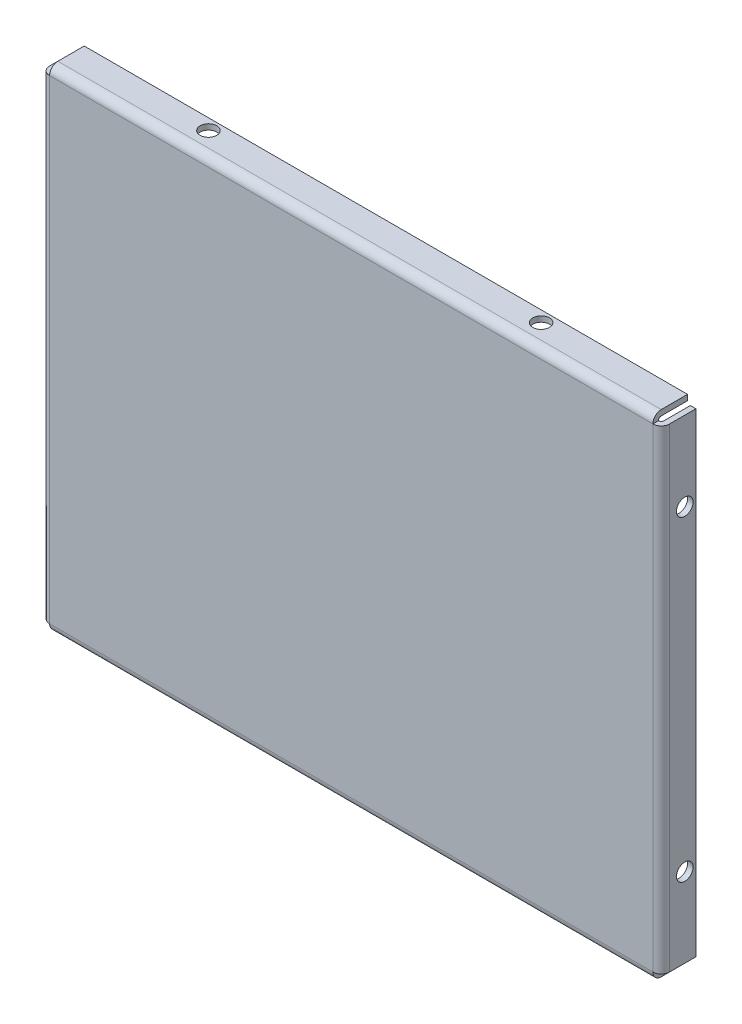
ISO-10303-21;
HEADER;
FILE_DESCRIPTION(('STEP AP214'),'2;1');
FILE_NAME('part.step','',(''),(''),'','','');
FILE_SCHEMA(('AUTOMOTIVE_DESIGN { 1 0 10303 214 1 1 1 1 }'));
ENDSEC;
DATA;
#1=APPLICATION_CONTEXT('core data for automotive mechanical design processes');
#2=APPLICATION_PROTOCOL_DEFINITION('international standard','automotive_design',2000,#1);
#3=PRODUCT_CONTEXT('',#1,'mechanical');
#4=PRODUCT('Part','Part','',(#3));
#5=PRODUCT_RELATED_PRODUCT_CATEGORY('part','',(#4));
#6=PRODUCT_DEFINITION_FORMATION('','',#4);
#7=PRODUCT_DEFINITION_CONTEXT('part definition',#1,'design');
#8=PRODUCT_DEFINITION('design','',#6,#7);
#9=PRODUCT_DEFINITION_SHAPE('','',#8);
#10=(LENGTH_UNIT() NAMED_UNIT(*) SI_UNIT(.MILLI.,.METRE.));
#11=(NAMED_UNIT(*) PLANE_ANGLE_UNIT() SI_UNIT($,.RADIAN.));
#12=(NAMED_UNIT(*) SI_UNIT($,.STERADIAN.) SOLID_ANGLE_UNIT());
#13=UNCERTAINTY_MEASURE_WITH_UNIT(LENGTH_MEASURE(1.E-05),#10,'distance_accuracy_value','');
#14=(GEOMETRIC_REPRESENTATION_CONTEXT(3) GLOBAL_UNCERTAINTY_ASSIGNED_CONTEXT((#13)) GLOBAL_UNIT_ASSIGNED_CONTEXT((#10,
#11,#12)) REPRESENTATION_CONTEXT('',''));
#15=CARTESIAN_POINT('',(0.,0.,0.));
#16=DIRECTION('',(0.,0.,1.));
#17=DIRECTION('',(1.,0.,0.));
#18=AXIS2_PLACEMENT_3D('',#15,#16,#17);
#19=CARTESIAN_POINT('',(0.,0.,1.7));
#20=DIRECTION('',(0.,0.,-1.));
#21=DIRECTION('',(-1.,0.,0.));
#22=AXIS2_PLACEMENT_3D('',#19,#20,#21);
#23=PLANE('',#22);
#24=DIRECTION('',(0.,-1.,0.));
#25=VECTOR('',#24,1.);
#26=CARTESIAN_POINT('',(23.31,0.,1.7));
#27=LINE('',#26,#25);
#28=CARTESIAN_POINT('',(23.31,29.28,1.7));
#29=VERTEX_POINT('',#28);
#30=CARTESIAN_POINT('',(23.31,12.16,1.7));
#31=VERTEX_POINT('',#30);
#32=EDGE_CURVE('E135',#29,#31,#27,.T.);
#33=ORIENTED_EDGE('',*,*,#32,.F.);
#34=DIRECTION('',(1.,0.,0.));
#35=VECTOR('',#34,1.);
#36=CARTESIAN_POINT('',(1.55,29.28,1.7));
#37=LINE('',#36,#35);
#38=CARTESIAN_POINT('',(1.55,29.28,1.7));
#39=VERTEX_POINT('',#38);
#40=EDGE_CURVE('E246',#39,#29,#37,.T.);
#41=ORIENTED_EDGE('',*,*,#40,.F.);
#42=DIRECTION('',(0.,1.,0.));
#43=VECTOR('',#42,1.);
#44=CARTESIAN_POINT('',(1.55,0.,1.7));
#45=LINE('',#44,#43);
#46=CARTESIAN_POINT('',(1.55,12.16,1.7));
#47=VERTEX_POINT('',#46);
#48=EDGE_CURVE('E138',#47,#39,#45,.T.);
#49=ORIENTED_EDGE('',*,*,#48,.F.);
#50=DIRECTION('',(1.,0.,0.));
#51=VECTOR('',#50,1.);
#52=CARTESIAN_POINT('',(0.,12.16,1.7));
#53=LINE('',#52,#51);
#54=EDGE_CURVE('E124',#31,#47,#53,.F.);
#55=ORIENTED_EDGE('',*,*,#54,.F.);
#56=EDGE_LOOP('',(#33,#41,#49,#55));
#57=FACE_BOUND('',#56,.T.);
#58=ADVANCED_FACE('F17',(#57),#23,.F.);
#59=CARTESIAN_POINT('',(23.31,0.,1.4));
#60=DIRECTION('',(0.,-1.,0.));
#61=DIRECTION('',(0.,0.,-1.));
#62=AXIS2_PLACEMENT_3D('',#59,#60,#61);
#63=CYLINDRICAL_SURFACE('',#62,0.3);
#64=CARTESIAN_POINT('',(23.31,29.28,1.4));
#65=DIRECTION('',(0.,-1.,0.));
#66=DIRECTION('',(0.,0.,-1.));
#67=AXIS2_PLACEMENT_3D('',#64,#65,#66);
#68=CIRCLE('',#67,0.3);
#69=CARTESIAN_POINT('',(23.61,29.28,1.4));
#70=VERTEX_POINT('',#69);
#71=EDGE_CURVE('E116',#70,#29,#68,.T.);
#72=ORIENTED_EDGE('',*,*,#71,.T.);
#73=ORIENTED_EDGE('',*,*,#32,.T.);
#74=CARTESIAN_POINT('',(23.31,12.16,1.4));
#75=DIRECTION('',(0.,-1.,0.));
#76=DIRECTION('',(0.,0.,-1.));
#77=AXIS2_PLACEMENT_3D('',#74,#75,#76);
#78=CIRCLE('',#77,0.3);
#79=CARTESIAN_POINT('',(23.61,12.16,1.4));
#80=VERTEX_POINT('',#79);
#81=EDGE_CURVE('E20',#31,#80,#78,.F.);
#82=ORIENTED_EDGE('',*,*,#81,.T.);
#83=DIRECTION('',(0.,1.,0.));
#84=VECTOR('',#83,1.);
#85=CARTESIAN_POINT('',(23.61,29.58,1.4));
#86=LINE('',#85,#84);
#87=EDGE_CURVE('E258',#70,#80,#86,.F.);
#88=ORIENTED_EDGE('',*,*,#87,.F.);
#89=EDGE_LOOP('',(#72,#73,#82,#88));
#90=FACE_BOUND('',#89,.T.);
#91=ADVANCED_FACE('F151',(#90),#63,.T.);
#92=CARTESIAN_POINT('',(0.,12.16,1.4));
#93=DIRECTION('',(1.,0.,0.));
#94=DIRECTION('',(0.,0.,-1.));
#95=AXIS2_PLACEMENT_3D('',#92,#93,#94);
#96=CYLINDRICAL_SURFACE('',#95,0.3);
#97=CARTESIAN_POINT('',(23.31,12.16,1.4));
#98=DIRECTION('',(1.,0.,0.));
#99=DIRECTION('',(0.,0.,-1.));
#100=AXIS2_PLACEMENT_3D('',#97,#98,#99);
#101=CIRCLE('',#100,0.3);
#102=CARTESIAN_POINT('',(23.31,11.86,1.4));
#103=VERTEX_POINT('',#102);
#104=EDGE_CURVE('E120',#103,#31,#101,.F.);
#105=ORIENTED_EDGE('',*,*,#104,.T.);
#106=ORIENTED_EDGE('',*,*,#54,.T.);
#107=CARTESIAN_POINT('',(1.55,12.16,1.4));
#108=DIRECTION('',(1.,0.,0.));
#109=DIRECTION('',(0.,0.,-1.));
#110=AXIS2_PLACEMENT_3D('',#107,#108,#109);
#111=CIRCLE('',#110,0.3);
#112=CARTESIAN_POINT('',(1.55,11.86,1.4));
#113=VERTEX_POINT('',#112);
#114=EDGE_CURVE('E130',#47,#113,#111,.T.);
#115=ORIENTED_EDGE('',*,*,#114,.T.);
#116=DIRECTION('',(1.,0.,0.));
#117=VECTOR('',#116,1.);
#118=CARTESIAN_POINT('',(1.55,11.86,1.4));
#119=LINE('',#118,#117);
#120=EDGE_CURVE('E126',#113,#103,#119,.T.);
#121=ORIENTED_EDGE('',*,*,#120,.T.);
#122=EDGE_LOOP('',(#105,#106,#115,#121));
#123=FACE_BOUND('',#122,.T.);
#124=ADVANCED_FACE('F122',(#123),#96,.T.);
#125=CARTESIAN_POINT('',(1.55,0.,1.4));
#126=DIRECTION('',(0.,1.,0.));
#127=DIRECTION('',(0.,0.,1.));
#128=AXIS2_PLACEMENT_3D('',#125,#126,#127);
#129=CYLINDRICAL_SURFACE('',#128,0.3);
#130=CARTESIAN_POINT('',(1.55,29.28,1.4));
#131=DIRECTION('',(0.,1.,0.));
#132=DIRECTION('',(0.,0.,1.));
#133=AXIS2_PLACEMENT_3D('',#130,#131,#132);
#134=CIRCLE('',#133,0.3);
#135=CARTESIAN_POINT('',(1.25,29.28,1.4));
#136=VERTEX_POINT('',#135);
#137=EDGE_CURVE('E250',#39,#136,#134,.F.);
#138=ORIENTED_EDGE('',*,*,#137,.T.);
#139=DIRECTION('',(0.,1.,0.));
#140=VECTOR('',#139,1.);
#141=CARTESIAN_POINT('',(1.25,0.,1.4));
#142=LINE('',#141,#140);
#143=CARTESIAN_POINT('',(1.25,12.16,1.4));
#144=VERTEX_POINT('',#143);
#145=EDGE_CURVE('E263',#136,#144,#142,.F.);
#146=ORIENTED_EDGE('',*,*,#145,.T.);
#147=CARTESIAN_POINT('',(1.55,12.16,1.4));
#148=DIRECTION('',(0.,1.,0.));
#149=DIRECTION('',(0.,0.,1.));
#150=AXIS2_PLACEMENT_3D('',#147,#148,#149);
#151=CIRCLE('',#150,0.3);
#152=EDGE_CURVE('E140',#144,#47,#151,.T.);
#153=ORIENTED_EDGE('',*,*,#152,.T.);
#154=ORIENTED_EDGE('',*,*,#48,.T.);
#155=EDGE_LOOP('',(#138,#146,#153,#154));
#156=FACE_BOUND('',#155,.T.);
#157=ADVANCED_FACE('F559',(#156),#129,.T.);
#158=CARTESIAN_POINT('',(1.55,29.28,1.4));
#159=DIRECTION('',(1.,0.,0.));
#160=DIRECTION('',(0.,0.,-1.));
#161=AXIS2_PLACEMENT_3D('',#158,#159,#160);
#162=CYLINDRICAL_SURFACE('',#161,0.3);
#163=CARTESIAN_POINT('',(23.31,29.28,1.4));
#164=DIRECTION('',(1.,0.,0.));
#165=DIRECTION('',(0.,0.,-1.));
#166=AXIS2_PLACEMENT_3D('',#163,#164,#165);
#167=CIRCLE('',#166,0.3);
#168=CARTESIAN_POINT('',(23.31,29.58,1.4));
#169=VERTEX_POINT('',#168);
#170=EDGE_CURVE('E242',#29,#169,#167,.F.);
#171=ORIENTED_EDGE('',*,*,#170,.T.);
#172=DIRECTION('',(1.,0.,0.));
#173=VECTOR('',#172,1.);
#174=CARTESIAN_POINT('',(1.55,29.58,1.4));
#175=LINE('',#174,#173);
#176=CARTESIAN_POINT('',(1.55,29.58,1.4));
#177=VERTEX_POINT('',#176);
#178=EDGE_CURVE('E267',#169,#177,#175,.F.);
#179=ORIENTED_EDGE('',*,*,#178,.T.);
#180=CARTESIAN_POINT('',(1.55,29.28,1.4));
#181=DIRECTION('',(1.,0.,0.));
#182=DIRECTION('',(0.,0.,-1.));
#183=AXIS2_PLACEMENT_3D('',#180,#181,#182);
#184=CIRCLE('',#183,0.3);
#185=EDGE_CURVE('E247',#177,#39,#184,.T.);
#186=ORIENTED_EDGE('',*,*,#185,.T.);
#187=ORIENTED_EDGE('',*,*,#40,.T.);
#188=EDGE_LOOP('',(#171,#179,#186,#187));
#189=FACE_BOUND('',#188,.T.);
#190=ADVANCED_FACE('F557',(#189),#162,.T.);
#191=CARTESIAN_POINT('',(23.61,29.58,0.4));
#192=DIRECTION('',(1.,0.,0.));
#193=DIRECTION('',(0.,0.,-1.));
#194=AXIS2_PLACEMENT_3D('',#191,#192,#193);
#195=PLANE('',#194);
#196=DIRECTION('',(0.,0.,-1.));
#197=VECTOR('',#196,1.);
#198=CARTESIAN_POINT('',(23.61,12.16,0.4));
#199=LINE('',#198,#197);
#200=CARTESIAN_POINT('',(23.61,12.16,0.45));
#201=VERTEX_POINT('',#200);
#202=EDGE_CURVE('E111',#80,#201,#199,.T.);
#203=ORIENTED_EDGE('',*,*,#202,.T.);
#204=DIRECTION('',(0.,1.,0.));
#205=VECTOR('',#204,1.);
#206=CARTESIAN_POINT('',(23.61,0.,0.45));
#207=LINE('',#206,#205);
#208=CARTESIAN_POINT('',(23.61,29.28,0.45));
#209=VERTEX_POINT('',#208);
#210=EDGE_CURVE('E280',#201,#209,#207,.T.);
#211=ORIENTED_EDGE('',*,*,#210,.T.);
#212=DIRECTION('',(0.,0.,-1.));
#213=VECTOR('',#212,1.);
#214=CARTESIAN_POINT('',(23.61,29.28,0.4));
#215=LINE('',#214,#213);
#216=EDGE_CURVE('E245',#209,#70,#215,.F.);
#217=ORIENTED_EDGE('',*,*,#216,.T.);
#218=ORIENTED_EDGE('',*,*,#87,.T.);
#219=EDGE_LOOP('',(#203,#211,#217,#218));
#220=FACE_BOUND('',#219,.T.);
#221=CARTESIAN_POINT('',(23.61,26.42,0.85));
#222=DIRECTION('',(1.,0.,0.));
#223=DIRECTION('',(0.,0.,-1.));
#224=AXIS2_PLACEMENT_3D('',#221,#222,#223);
#225=CIRCLE('',#224,0.299999999999988);
#226=CARTESIAN_POINT('',(23.61,26.42,0.550000000000012));
#227=VERTEX_POINT('',#226);
#228=EDGE_CURVE('E234',#227,#227,#225,.F.);
#229=ORIENTED_EDGE('',*,*,#228,.T.);
#230=EDGE_LOOP('',(#229));
#231=FACE_BOUND('',#230,.T.);
#232=CARTESIAN_POINT('',(23.61,15.02,0.85));
#233=DIRECTION('',(1.,0.,0.));
#234=DIRECTION('',(0.,0.,-1.));
#235=AXIS2_PLACEMENT_3D('',#232,#233,#234);
#236=CIRCLE('',#235,0.299999999999988);
#237=CARTESIAN_POINT('',(23.61,15.02,0.550000000000012));
#238=VERTEX_POINT('',#237);
#239=EDGE_CURVE('E238',#238,#238,#236,.F.);
#240=ORIENTED_EDGE('',*,*,#239,.T.);
#241=EDGE_LOOP('',(#240));
#242=FACE_BOUND('',#241,.T.);
#243=ADVANCED_FACE('F492',(#220,#231,#242),#195,.T.);
#244=CARTESIAN_POINT('',(1.55,11.86,1.7));
#245=DIRECTION('',(0.,1.,0.));
#246=DIRECTION('',(0.,0.,1.));
#247=AXIS2_PLACEMENT_3D('',#244,#245,#246);
#248=PLANE('',#247);
#249=ORIENTED_EDGE('',*,*,#120,.F.);
#250=DIRECTION('',(0.,0.,1.));
#251=VECTOR('',#250,1.);
#252=CARTESIAN_POINT('',(1.55,11.86,1.7));
#253=LINE('',#252,#251);
#254=CARTESIAN_POINT('',(1.55,11.86,0.45));
#255=VERTEX_POINT('',#254);
#256=EDGE_CURVE('E262',#255,#113,#253,.T.);
#257=ORIENTED_EDGE('',*,*,#256,.F.);
#258=DIRECTION('',(1.,0.,0.));
#259=VECTOR('',#258,1.);
#260=CARTESIAN_POINT('',(1.55,11.86,0.45));
#261=LINE('',#260,#259);
#262=CARTESIAN_POINT('',(23.31,11.86,0.45));
#263=VERTEX_POINT('',#262);
#264=EDGE_CURVE('E291',#255,#263,#261,.T.);
#265=ORIENTED_EDGE('',*,*,#264,.T.);
#266=DIRECTION('',(0.,0.,1.));
#267=VECTOR('',#266,1.);
#268=CARTESIAN_POINT('',(23.31,11.86,1.7));
#269=LINE('',#268,#267);
#270=EDGE_CURVE('E261',#103,#263,#269,.F.);
#271=ORIENTED_EDGE('',*,*,#270,.F.);
#272=EDGE_LOOP('',(#249,#257,#265,#271));
#273=FACE_BOUND('',#272,.T.);
#274=CARTESIAN_POINT('',(6.43,11.86,0.85));
#275=DIRECTION('',(0.,-1.,0.));
#276=DIRECTION('',(0.,0.,-1.));
#277=AXIS2_PLACEMENT_3D('',#274,#275,#276);
#278=CIRCLE('',#277,0.299999999999988);
#279=CARTESIAN_POINT('',(6.43,11.86,0.550000000000012));
#280=VERTEX_POINT('',#279);
#281=EDGE_CURVE('E226',#280,#280,#278,.F.);
#282=ORIENTED_EDGE('',*,*,#281,.T.);
#283=EDGE_LOOP('',(#282));
#284=FACE_BOUND('',#283,.T.);
#285=CARTESIAN_POINT('',(18.43,11.86,0.85));
#286=DIRECTION('',(0.,-1.,0.));
#287=DIRECTION('',(0.,0.,-1.));
#288=AXIS2_PLACEMENT_3D('',#285,#286,#287);
#289=CIRCLE('',#288,0.299999999999988);
#290=CARTESIAN_POINT('',(18.43,11.86,0.550000000000012));
#291=VERTEX_POINT('',#290);
#292=EDGE_CURVE('E230',#291,#291,#289,.F.);
#293=ORIENTED_EDGE('',*,*,#292,.T.);
#294=EDGE_LOOP('',(#293));
#295=FACE_BOUND('',#294,.T.);
#296=ADVANCED_FACE('F565',(#273,#284,#295),#248,.F.);
#297=CARTESIAN_POINT('',(1.25,0.,0.));
#298=DIRECTION('',(1.,0.,0.));
#299=DIRECTION('',(0.,0.,-1.));
#300=AXIS2_PLACEMENT_3D('',#297,#298,#299);
#301=PLANE('',#300);
#302=ORIENTED_EDGE('',*,*,#145,.F.);
#303=DIRECTION('',(0.,0.,-1.));
#304=VECTOR('',#303,1.);
#305=CARTESIAN_POINT('',(1.25,29.28,0.));
#306=LINE('',#305,#304);
#307=CARTESIAN_POINT('',(1.25,29.28,0.45));
#308=VERTEX_POINT('',#307);
#309=EDGE_CURVE('E266',#308,#136,#306,.F.);
#310=ORIENTED_EDGE('',*,*,#309,.F.);
#311=DIRECTION('',(0.,1.,0.));
#312=VECTOR('',#311,1.);
#313=CARTESIAN_POINT('',(1.25,0.,0.45));
#314=LINE('',#313,#312);
#315=CARTESIAN_POINT('',(1.25,12.16,0.45));
#316=VERTEX_POINT('',#315);
#317=EDGE_CURVE('E221',#308,#316,#314,.F.);
#318=ORIENTED_EDGE('',*,*,#317,.T.);
#319=DIRECTION('',(0.,0.,-1.));
#320=VECTOR('',#319,1.);
#321=CARTESIAN_POINT('',(1.25,12.16,0.));
#322=LINE('',#321,#320);
#323=EDGE_CURVE('E265',#144,#316,#322,.T.);
#324=ORIENTED_EDGE('',*,*,#323,.F.);
#325=EDGE_LOOP('',(#302,#310,#318,#324));
#326=FACE_BOUND('',#325,.T.);
#327=CARTESIAN_POINT('',(1.25,26.42,0.85));
#328=DIRECTION('',(1.,0.,0.));
#329=DIRECTION('',(0.,0.,-1.));
#330=AXIS2_PLACEMENT_3D('',#327,#328,#329);
#331=CIRCLE('',#330,0.299999999999988);
#332=CARTESIAN_POINT('',(1.25,26.42,0.550000000000012));
#333=VERTEX_POINT('',#332);
#334=EDGE_CURVE('E218',#333,#333,#331,.T.);
#335=ORIENTED_EDGE('',*,*,#334,.T.);
#336=EDGE_LOOP('',(#335));
#337=FACE_BOUND('',#336,.T.);
#338=CARTESIAN_POINT('',(1.25,15.02,0.85));
#339=DIRECTION('',(1.,0.,0.));
#340=DIRECTION('',(0.,0.,-1.));
#341=AXIS2_PLACEMENT_3D('',#338,#339,#340);
#342=CIRCLE('',#341,0.299999999999988);
#343=CARTESIAN_POINT('',(1.25,15.02,0.550000000000012));
#344=VERTEX_POINT('',#343);
#345=EDGE_CURVE('E222',#344,#344,#342,.T.);
#346=ORIENTED_EDGE('',*,*,#345,.T.);
#347=EDGE_LOOP('',(#346));
#348=FACE_BOUND('',#347,.T.);
#349=ADVANCED_FACE('F617',(#326,#337,#348),#301,.F.);
#350=CARTESIAN_POINT('',(1.55,29.58,0.45));
#351=DIRECTION('',(0.,-1.,0.));
#352=DIRECTION('',(0.,0.,-1.));
#353=AXIS2_PLACEMENT_3D('',#350,#351,#352);
#354=PLANE('',#353);
#355=ORIENTED_EDGE('',*,*,#178,.F.);
#356=DIRECTION('',(0.,0.,-1.));
#357=VECTOR('',#356,1.);
#358=CARTESIAN_POINT('',(23.31,29.58,0.45));
#359=LINE('',#358,#357);
#360=CARTESIAN_POINT('',(23.31,29.58,0.45));
#361=VERTEX_POINT('',#360);
#362=EDGE_CURVE('E270',#361,#169,#359,.F.);
#363=ORIENTED_EDGE('',*,*,#362,.F.);
#364=DIRECTION('',(1.,0.,0.));
#365=VECTOR('',#364,1.);
#366=CARTESIAN_POINT('',(1.55,29.58,0.45));
#367=LINE('',#366,#365);
#368=CARTESIAN_POINT('',(1.55,29.58,0.45));
#369=VERTEX_POINT('',#368);
#370=EDGE_CURVE('E213',#361,#369,#367,.F.);
#371=ORIENTED_EDGE('',*,*,#370,.T.);
#372=DIRECTION('',(0.,0.,-1.));
#373=VECTOR('',#372,1.);
#374=CARTESIAN_POINT('',(1.55,29.58,0.45));
#375=LINE('',#374,#373);
#376=EDGE_CURVE('E241',#177,#369,#375,.T.);
#377=ORIENTED_EDGE('',*,*,#376,.F.);
#378=EDGE_LOOP('',(#355,#363,#371,#377));
#379=FACE_BOUND('',#378,.T.);
#380=CARTESIAN_POINT('',(6.43,29.58,0.85));
#381=DIRECTION('',(0.,-1.,0.));
#382=DIRECTION('',(0.,0.,-1.));
#383=AXIS2_PLACEMENT_3D('',#380,#381,#382);
#384=CIRCLE('',#383,0.299999999999988);
#385=CARTESIAN_POINT('',(6.43,29.58,0.550000000000012));
#386=VERTEX_POINT('',#385);
#387=EDGE_CURVE('E210',#386,#386,#384,.T.);
#388=ORIENTED_EDGE('',*,*,#387,.T.);
#389=EDGE_LOOP('',(#388));
#390=FACE_BOUND('',#389,.T.);
#391=CARTESIAN_POINT('',(18.43,29.58,0.85));
#392=DIRECTION('',(0.,-1.,0.));
#393=DIRECTION('',(0.,0.,-1.));
#394=AXIS2_PLACEMENT_3D('',#391,#392,#393);
#395=CIRCLE('',#394,0.299999999999988);
#396=CARTESIAN_POINT('',(18.43,29.58,0.550000000000012));
#397=VERTEX_POINT('',#396);
#398=EDGE_CURVE('E214',#397,#397,#395,.T.);
#399=ORIENTED_EDGE('',*,*,#398,.T.);
#400=EDGE_LOOP('',(#399));
#401=FACE_BOUND('',#400,.T.);
#402=ADVANCED_FACE('F553',(#379,#390,#401),#354,.F.);
#403=CARTESIAN_POINT('',(23.61,15.02,0.85));
#404=DIRECTION('',(1.,0.,0.));
#405=DIRECTION('',(0.,0.,-1.));
#406=AXIS2_PLACEMENT_3D('',#403,#404,#405);
#407=CYLINDRICAL_SURFACE('',#406,0.299999999999988);
#408=CARTESIAN_POINT('',(23.41,15.02,0.85));
#409=DIRECTION('',(1.,0.,0.));
#410=DIRECTION('',(0.,0.,-1.));
#411=AXIS2_PLACEMENT_3D('',#408,#409,#410);
#412=CIRCLE('',#411,0.299999999999988);
#413=CARTESIAN_POINT('',(23.41,15.02,0.550000000000012));
#414=VERTEX_POINT('',#413);
#415=EDGE_CURVE('E206',#414,#414,#412,.F.);
#416=ORIENTED_EDGE('',*,*,#415,.T.);
#417=EDGE_LOOP('',(#416));
#418=FACE_BOUND('',#417,.T.);
#419=ORIENTED_EDGE('',*,*,#239,.F.);
#420=EDGE_LOOP('',(#419));
#421=FACE_BOUND('',#420,.T.);
#422=ADVANCED_FACE('F635',(#418,#421),#407,.F.);
#423=CARTESIAN_POINT('',(23.61,26.42,0.85));
#424=DIRECTION('',(1.,0.,0.));
#425=DIRECTION('',(0.,0.,-1.));
#426=AXIS2_PLACEMENT_3D('',#423,#424,#425);
#427=CYLINDRICAL_SURFACE('',#426,0.299999999999988);
#428=CARTESIAN_POINT('',(23.41,26.42,0.85));
#429=DIRECTION('',(1.,0.,0.));
#430=DIRECTION('',(0.,0.,-1.));
#431=AXIS2_PLACEMENT_3D('',#428,#429,#430);
#432=CIRCLE('',#431,0.299999999999988);
#433=CARTESIAN_POINT('',(23.41,26.42,0.550000000000012));
#434=VERTEX_POINT('',#433);
#435=EDGE_CURVE('E202',#434,#434,#432,.F.);
#436=ORIENTED_EDGE('',*,*,#435,.T.);
#437=EDGE_LOOP('',(#436));
#438=FACE_BOUND('',#437,.T.);
#439=ORIENTED_EDGE('',*,*,#228,.F.);
#440=EDGE_LOOP('',(#439));
#441=FACE_BOUND('',#440,.T.);
#442=ADVANCED_FACE('F644',(#438,#441),#427,.F.);
#443=CARTESIAN_POINT('',(0.,0.,0.45));
#444=DIRECTION('',(0.,0.,1.));
#445=DIRECTION('',(1.,0.,0.));
#446=AXIS2_PLACEMENT_3D('',#443,#444,#445);
#447=PLANE('',#446);
#448=ORIENTED_EDGE('',*,*,#210,.F.);
#449=DIRECTION('',(1.,0.,0.));
#450=VECTOR('',#449,1.);
#451=CARTESIAN_POINT('',(0.,12.16,0.45));
#452=LINE('',#451,#450);
#453=CARTESIAN_POINT('',(23.41,12.16,0.45));
#454=VERTEX_POINT('',#453);
#455=EDGE_CURVE('E237',#454,#201,#452,.T.);
#456=ORIENTED_EDGE('',*,*,#455,.F.);
#457=DIRECTION('',(0.,1.,0.));
#458=VECTOR('',#457,1.);
#459=CARTESIAN_POINT('',(23.41,29.28,0.45));
#460=LINE('',#459,#458);
#461=CARTESIAN_POINT('',(23.41,29.28,0.45));
#462=VERTEX_POINT('',#461);
#463=EDGE_CURVE('E205',#454,#462,#460,.T.);
#464=ORIENTED_EDGE('',*,*,#463,.T.);
#465=DIRECTION('',(1.,0.,0.));
#466=VECTOR('',#465,1.);
#467=CARTESIAN_POINT('',(0.,29.28,0.45));
#468=LINE('',#467,#466);
#469=EDGE_CURVE('E233',#209,#462,#468,.F.);
#470=ORIENTED_EDGE('',*,*,#469,.F.);
#471=EDGE_LOOP('',(#448,#456,#464,#470));
#472=FACE_BOUND('',#471,.T.);
#473=ADVANCED_FACE('F495',(#472),#447,.F.);
#474=CARTESIAN_POINT('',(18.43,11.86,0.85));
#475=DIRECTION('',(0.,-1.,0.));
#476=DIRECTION('',(0.,0.,-1.));
#477=AXIS2_PLACEMENT_3D('',#474,#475,#476);
#478=CYLINDRICAL_SURFACE('',#477,0.299999999999988);
#479=CARTESIAN_POINT('',(18.43,12.06,0.85));
#480=DIRECTION('',(0.,-1.,0.));
#481=DIRECTION('',(0.,0.,-1.));
#482=AXIS2_PLACEMENT_3D('',#479,#480,#481);
#483=CIRCLE('',#482,0.299999999999988);
#484=CARTESIAN_POINT('',(18.43,12.06,0.550000000000012));
#485=VERTEX_POINT('',#484);
#486=EDGE_CURVE('E198',#485,#485,#483,.F.);
#487=ORIENTED_EDGE('',*,*,#486,.T.);
#488=EDGE_LOOP('',(#487));
#489=FACE_BOUND('',#488,.T.);
#490=ORIENTED_EDGE('',*,*,#292,.F.);
#491=EDGE_LOOP('',(#490));
#492=FACE_BOUND('',#491,.T.);
#493=ADVANCED_FACE('F663',(#489,#492),#478,.F.);
#494=CARTESIAN_POINT('',(6.43,11.86,0.85));
#495=DIRECTION('',(0.,-1.,0.));
#496=DIRECTION('',(0.,0.,-1.));
#497=AXIS2_PLACEMENT_3D('',#494,#495,#496);
#498=CYLINDRICAL_SURFACE('',#497,0.299999999999988);
#499=CARTESIAN_POINT('',(6.43,12.06,0.85));
#500=DIRECTION('',(0.,-1.,0.));
#501=DIRECTION('',(0.,0.,-1.));
#502=AXIS2_PLACEMENT_3D('',#499,#500,#501);
#503=CIRCLE('',#502,0.299999999999988);
#504=CARTESIAN_POINT('',(6.43,12.06,0.550000000000012));
#505=VERTEX_POINT('',#504);
#506=EDGE_CURVE('E195',#505,#505,#503,.F.);
#507=ORIENTED_EDGE('',*,*,#506,.T.);
#508=EDGE_LOOP('',(#507));
#509=FACE_BOUND('',#508,.T.);
#510=ORIENTED_EDGE('',*,*,#281,.F.);
#511=EDGE_LOOP('',(#510));
#512=FACE_BOUND('',#511,.T.);
#513=ADVANCED_FACE('F672',(#509,#512),#498,.F.);
#514=CARTESIAN_POINT('',(1.55,11.86,0.45));
#515=DIRECTION('',(0.,0.,1.));
#516=DIRECTION('',(0.,-1.,0.));
#517=AXIS2_PLACEMENT_3D('',#514,#515,#516);
#518=PLANE('',#517);
#519=ORIENTED_EDGE('',*,*,#264,.F.);
#520=DIRECTION('',(0.,-1.,0.));
#521=VECTOR('',#520,1.);
#522=CARTESIAN_POINT('',(1.55,11.86,0.45));
#523=LINE('',#522,#521);
#524=CARTESIAN_POINT('',(1.55,12.06,0.45));
#525=VERTEX_POINT('',#524);
#526=EDGE_CURVE('E229',#525,#255,#523,.T.);
#527=ORIENTED_EDGE('',*,*,#526,.F.);
#528=DIRECTION('',(1.,0.,0.));
#529=VECTOR('',#528,1.);
#530=CARTESIAN_POINT('',(1.55,12.06,0.45));
#531=LINE('',#530,#529);
#532=CARTESIAN_POINT('',(23.31,12.06,0.45));
#533=VERTEX_POINT('',#532);
#534=EDGE_CURVE('E148',#525,#533,#531,.T.);
#535=ORIENTED_EDGE('',*,*,#534,.T.);
#536=DIRECTION('',(0.,-1.,0.));
#537=VECTOR('',#536,1.);
#538=CARTESIAN_POINT('',(23.31,11.86,0.45));
#539=LINE('',#538,#537);
#540=EDGE_CURVE('E225',#263,#533,#539,.F.);
#541=ORIENTED_EDGE('',*,*,#540,.F.);
#542=EDGE_LOOP('',(#519,#527,#535,#541));
#543=FACE_BOUND('',#542,.T.);
#544=ADVANCED_FACE('F682',(#543),#518,.F.);
#545=CARTESIAN_POINT('',(23.61,15.02,0.85));
#546=DIRECTION('',(1.,0.,0.));
#547=DIRECTION('',(0.,0.,-1.));
#548=AXIS2_PLACEMENT_3D('',#545,#546,#547);
#549=CYLINDRICAL_SURFACE('',#548,0.299999999999988);
#550=CARTESIAN_POINT('',(1.45,15.02,0.85));
#551=DIRECTION('',(1.,0.,0.));
#552=DIRECTION('',(0.,0.,-1.));
#553=AXIS2_PLACEMENT_3D('',#550,#551,#552);
#554=CIRCLE('',#553,0.299999999999988);
#555=CARTESIAN_POINT('',(1.45,15.02,0.550000000000012));
#556=VERTEX_POINT('',#555);
#557=EDGE_CURVE('E191',#556,#556,#554,.T.);
#558=ORIENTED_EDGE('',*,*,#557,.T.);
#559=EDGE_LOOP('',(#558));
#560=FACE_BOUND('',#559,.T.);
#561=ORIENTED_EDGE('',*,*,#345,.F.);
#562=EDGE_LOOP('',(#561));
#563=FACE_BOUND('',#562,.T.);
#564=ADVANCED_FACE('F692',(#560,#563),#549,.F.);
#565=CARTESIAN_POINT('',(23.61,26.42,0.85));
#566=DIRECTION('',(1.,0.,0.));
#567=DIRECTION('',(0.,0.,-1.));
#568=AXIS2_PLACEMENT_3D('',#565,#566,#567);
#569=CYLINDRICAL_SURFACE('',#568,0.299999999999988);
#570=CARTESIAN_POINT('',(1.45,26.42,0.85));
#571=DIRECTION('',(1.,0.,0.));
#572=DIRECTION('',(0.,0.,-1.));
#573=AXIS2_PLACEMENT_3D('',#570,#571,#572);
#574=CIRCLE('',#573,0.299999999999988);
#575=CARTESIAN_POINT('',(1.45,26.42,0.550000000000012));
#576=VERTEX_POINT('',#575);
#577=EDGE_CURVE('E187',#576,#576,#574,.T.);
#578=ORIENTED_EDGE('',*,*,#577,.T.);
#579=EDGE_LOOP('',(#578));
#580=FACE_BOUND('',#579,.T.);
#581=ORIENTED_EDGE('',*,*,#334,.F.);
#582=EDGE_LOOP('',(#581));
#583=FACE_BOUND('',#582,.T.);
#584=ADVANCED_FACE('F702',(#580,#583),#569,.F.);
#585=CARTESIAN_POINT('',(0.,0.,0.45));
#586=DIRECTION('',(0.,0.,1.));
#587=DIRECTION('',(1.,0.,0.));
#588=AXIS2_PLACEMENT_3D('',#585,#586,#587);
#589=PLANE('',#588);
#590=DIRECTION('',(0.,1.,0.));
#591=VECTOR('',#590,1.);
#592=CARTESIAN_POINT('',(1.45,12.16,0.45));
#593=LINE('',#592,#591);
#594=CARTESIAN_POINT('',(1.45,29.28,0.45));
#595=VERTEX_POINT('',#594);
#596=CARTESIAN_POINT('',(1.45,12.16,0.45));
#597=VERTEX_POINT('',#596);
#598=EDGE_CURVE('E190',#595,#597,#593,.F.);
#599=ORIENTED_EDGE('',*,*,#598,.T.);
#600=DIRECTION('',(1.,0.,0.));
#601=VECTOR('',#600,1.);
#602=CARTESIAN_POINT('',(0.,12.16,0.45));
#603=LINE('',#602,#601);
#604=EDGE_CURVE('E305',#316,#597,#603,.T.);
#605=ORIENTED_EDGE('',*,*,#604,.F.);
#606=ORIENTED_EDGE('',*,*,#317,.F.);
#607=DIRECTION('',(1.,0.,0.));
#608=VECTOR('',#607,1.);
#609=CARTESIAN_POINT('',(0.,29.28,0.45));
#610=LINE('',#609,#608);
#611=EDGE_CURVE('E217',#595,#308,#610,.F.);
#612=ORIENTED_EDGE('',*,*,#611,.F.);
#613=EDGE_LOOP('',(#599,#605,#606,#612));
#614=FACE_BOUND('',#613,.T.);
#615=ADVANCED_FACE('F456',(#614),#589,.F.);
#616=CARTESIAN_POINT('',(18.43,11.86,0.85));
#617=DIRECTION('',(0.,-1.,0.));
#618=DIRECTION('',(0.,0.,-1.));
#619=AXIS2_PLACEMENT_3D('',#616,#617,#618);
#620=CYLINDRICAL_SURFACE('',#619,0.299999999999988);
#621=CARTESIAN_POINT('',(18.43,29.38,0.85));
#622=DIRECTION('',(0.,-1.,0.));
#623=DIRECTION('',(0.,0.,-1.));
#624=AXIS2_PLACEMENT_3D('',#621,#622,#623);
#625=CIRCLE('',#624,0.299999999999988);
#626=CARTESIAN_POINT('',(18.43,29.38,0.550000000000012));
#627=VERTEX_POINT('',#626);
#628=EDGE_CURVE('E183',#627,#627,#625,.T.);
#629=ORIENTED_EDGE('',*,*,#628,.T.);
#630=EDGE_LOOP('',(#629));
#631=FACE_BOUND('',#630,.T.);
#632=ORIENTED_EDGE('',*,*,#398,.F.);
#633=EDGE_LOOP('',(#632));
#634=FACE_BOUND('',#633,.T.);
#635=ADVANCED_FACE('F721',(#631,#634),#620,.F.);
#636=CARTESIAN_POINT('',(6.43,11.86,0.85));
#637=DIRECTION('',(0.,-1.,0.));
#638=DIRECTION('',(0.,0.,-1.));
#639=AXIS2_PLACEMENT_3D('',#636,#637,#638);
#640=CYLINDRICAL_SURFACE('',#639,0.299999999999988);
#641=CARTESIAN_POINT('',(6.43,29.38,0.85));
#642=DIRECTION('',(0.,-1.,0.));
#643=DIRECTION('',(0.,0.,-1.));
#644=AXIS2_PLACEMENT_3D('',#641,#642,#643);
#645=CIRCLE('',#644,0.299999999999988);
#646=CARTESIAN_POINT('',(6.43,29.38,0.550000000000012));
#647=VERTEX_POINT('',#646);
#648=EDGE_CURVE('E179',#647,#647,#645,.T.);
#649=ORIENTED_EDGE('',*,*,#648,.T.);
#650=EDGE_LOOP('',(#649));
#651=FACE_BOUND('',#650,.T.);
#652=ORIENTED_EDGE('',*,*,#387,.F.);
#653=EDGE_LOOP('',(#652));
#654=FACE_BOUND('',#653,.T.);
#655=ADVANCED_FACE('F730',(#651,#654),#640,.F.);
#656=CARTESIAN_POINT('',(1.55,29.38,0.45));
#657=DIRECTION('',(0.,0.,1.));
#658=DIRECTION('',(0.,-1.,0.));
#659=AXIS2_PLACEMENT_3D('',#656,#657,#658);
#660=PLANE('',#659);
#661=DIRECTION('',(1.,0.,0.));
#662=VECTOR('',#661,1.);
#663=CARTESIAN_POINT('',(1.55,29.38,0.45));
#664=LINE('',#663,#662);
#665=CARTESIAN_POINT('',(23.31,29.38,0.45));
#666=VERTEX_POINT('',#665);
#667=CARTESIAN_POINT('',(1.55,29.38,0.45));
#668=VERTEX_POINT('',#667);
#669=EDGE_CURVE('E182',#666,#668,#664,.F.);
#670=ORIENTED_EDGE('',*,*,#669,.T.);
#671=DIRECTION('',(0.,-1.,0.));
#672=VECTOR('',#671,1.);
#673=CARTESIAN_POINT('',(1.55,29.38,0.45));
#674=LINE('',#673,#672);
#675=EDGE_CURVE('E209',#369,#668,#674,.T.);
#676=ORIENTED_EDGE('',*,*,#675,.F.);
#677=ORIENTED_EDGE('',*,*,#370,.F.);
#678=DIRECTION('',(0.,1.,0.));
#679=VECTOR('',#678,1.);
#680=CARTESIAN_POINT('',(23.31,0.,0.45));
#681=LINE('',#680,#679);
#682=EDGE_CURVE('E186',#666,#361,#681,.T.);
#683=ORIENTED_EDGE('',*,*,#682,.F.);
#684=EDGE_LOOP('',(#670,#676,#677,#683));
#685=FACE_BOUND('',#684,.T.);
#686=ADVANCED_FACE('F549',(#685),#660,.F.);
#687=CARTESIAN_POINT('',(23.41,29.28,0.45));
#688=DIRECTION('',(1.,0.,0.));
#689=DIRECTION('',(0.,0.,-1.));
#690=AXIS2_PLACEMENT_3D('',#687,#688,#689);
#691=PLANE('',#690);
#692=DIRECTION('',(0.,1.,0.));
#693=VECTOR('',#692,1.);
#694=CARTESIAN_POINT('',(23.41,29.28,1.4));
#695=LINE('',#694,#693);
#696=CARTESIAN_POINT('',(23.41,12.16,1.4));
#697=VERTEX_POINT('',#696);
#698=CARTESIAN_POINT('',(23.41,29.28,1.4));
#699=VERTEX_POINT('',#698);
#700=EDGE_CURVE('E178',#697,#699,#695,.T.);
#701=ORIENTED_EDGE('',*,*,#700,.T.);
#702=DIRECTION('',(0.,0.,-1.));
#703=VECTOR('',#702,1.);
#704=CARTESIAN_POINT('',(23.41,29.28,1.7));
#705=LINE('',#704,#703);
#706=EDGE_CURVE('E324',#699,#462,#705,.T.);
#707=ORIENTED_EDGE('',*,*,#706,.T.);
#708=ORIENTED_EDGE('',*,*,#463,.F.);
#709=DIRECTION('',(0.,0.,1.));
#710=VECTOR('',#709,1.);
#711=CARTESIAN_POINT('',(23.41,12.16,1.7));
#712=LINE('',#711,#710);
#713=EDGE_CURVE('E201',#454,#697,#712,.T.);
#714=ORIENTED_EDGE('',*,*,#713,.T.);
#715=EDGE_LOOP('',(#701,#707,#708,#714));
#716=FACE_BOUND('',#715,.T.);
#717=ORIENTED_EDGE('',*,*,#435,.F.);
#718=EDGE_LOOP('',(#717));
#719=FACE_BOUND('',#718,.T.);
#720=ORIENTED_EDGE('',*,*,#415,.F.);
#721=EDGE_LOOP('',(#720));
#722=FACE_BOUND('',#721,.T.);
#723=ADVANCED_FACE('F499',(#716,#719,#722),#691,.F.);
#724=CARTESIAN_POINT('',(23.31,29.28,1.7));
#725=DIRECTION('',(0.,-1.,0.));
#726=DIRECTION('',(0.,0.,-1.));
#727=AXIS2_PLACEMENT_3D('',#724,#725,#726);
#728=PLANE('',#727);
#729=ORIENTED_EDGE('',*,*,#71,.F.);
#730=ORIENTED_EDGE('',*,*,#216,.F.);
#731=ORIENTED_EDGE('',*,*,#469,.T.);
#732=ORIENTED_EDGE('',*,*,#706,.F.);
#733=CARTESIAN_POINT('',(23.31,29.28,1.4));
#734=DIRECTION('',(0.,1.,0.));
#735=DIRECTION('',(0.,0.,1.));
#736=AXIS2_PLACEMENT_3D('',#733,#734,#735);
#737=CIRCLE('',#736,0.1);
#738=CARTESIAN_POINT('',(23.31,29.28,1.5));
#739=VERTEX_POINT('',#738);
#740=EDGE_CURVE('E176',#699,#739,#737,.F.);
#741=ORIENTED_EDGE('',*,*,#740,.T.);
#742=DIRECTION('',(0.,0.,-1.));
#743=VECTOR('',#742,1.);
#744=CARTESIAN_POINT('',(23.31,29.28,0.));
#745=LINE('',#744,#743);
#746=EDGE_CURVE('E362',#29,#739,#745,.T.);
#747=ORIENTED_EDGE('',*,*,#746,.F.);
#748=EDGE_LOOP('',(#729,#730,#731,#732,#741,#747));
#749=FACE_BOUND('',#748,.T.);
#750=ADVANCED_FACE('F486',(#749),#728,.F.);
#751=CARTESIAN_POINT('',(23.61,12.16,1.7));
#752=DIRECTION('',(0.,1.,0.));
#753=DIRECTION('',(0.,0.,1.));
#754=AXIS2_PLACEMENT_3D('',#751,#752,#753);
#755=PLANE('',#754);
#756=ORIENTED_EDGE('',*,*,#81,.F.);
#757=DIRECTION('',(0.,0.,-1.));
#758=VECTOR('',#757,1.);
#759=CARTESIAN_POINT('',(23.31,12.16,0.));
#760=LINE('',#759,#758);
#761=CARTESIAN_POINT('',(23.31,12.16,1.5));
#762=VERTEX_POINT('',#761);
#763=EDGE_CURVE('E107',#762,#31,#760,.F.);
#764=ORIENTED_EDGE('',*,*,#763,.F.);
#765=CARTESIAN_POINT('',(23.31,12.16,1.4));
#766=DIRECTION('',(0.,1.,0.));
#767=DIRECTION('',(0.,0.,1.));
#768=AXIS2_PLACEMENT_3D('',#765,#766,#767);
#769=CIRCLE('',#768,0.1);
#770=EDGE_CURVE('E174',#762,#697,#769,.T.);
#771=ORIENTED_EDGE('',*,*,#770,.T.);
#772=ORIENTED_EDGE('',*,*,#713,.F.);
#773=ORIENTED_EDGE('',*,*,#455,.T.);
#774=ORIENTED_EDGE('',*,*,#202,.F.);
#775=EDGE_LOOP('',(#756,#764,#771,#772,#773,#774));
#776=FACE_BOUND('',#775,.T.);
#777=ADVANCED_FACE('F104',(#776),#755,.F.);
#778=CARTESIAN_POINT('',(1.55,12.06,0.45));
#779=DIRECTION('',(0.,-1.,0.));
#780=DIRECTION('',(0.,0.,-1.));
#781=AXIS2_PLACEMENT_3D('',#778,#779,#780);
#782=PLANE('',#781);
#783=DIRECTION('',(1.,0.,0.));
#784=VECTOR('',#783,1.);
#785=CARTESIAN_POINT('',(1.55,12.06,1.4));
#786=LINE('',#785,#784);
#787=CARTESIAN_POINT('',(1.55,12.06,1.4));
#788=VERTEX_POINT('',#787);
#789=CARTESIAN_POINT('',(23.31,12.06,1.4));
#790=VERTEX_POINT('',#789);
#791=EDGE_CURVE('E173',#788,#790,#786,.T.);
#792=ORIENTED_EDGE('',*,*,#791,.T.);
#793=DIRECTION('',(0.,0.,-1.));
#794=VECTOR('',#793,1.);
#795=CARTESIAN_POINT('',(23.31,12.06,0.));
#796=LINE('',#795,#794);
#797=EDGE_CURVE('E147',#533,#790,#796,.F.);
#798=ORIENTED_EDGE('',*,*,#797,.F.);
#799=ORIENTED_EDGE('',*,*,#534,.F.);
#800=DIRECTION('',(0.,0.,-1.));
#801=VECTOR('',#800,1.);
#802=CARTESIAN_POINT('',(1.55,12.06,0.));
#803=LINE('',#802,#801);
#804=EDGE_CURVE('E194',#525,#788,#803,.F.);
#805=ORIENTED_EDGE('',*,*,#804,.T.);
#806=EDGE_LOOP('',(#792,#798,#799,#805));
#807=FACE_BOUND('',#806,.T.);
#808=ORIENTED_EDGE('',*,*,#506,.F.);
#809=EDGE_LOOP('',(#808));
#810=FACE_BOUND('',#809,.T.);
#811=ORIENTED_EDGE('',*,*,#486,.F.);
#812=EDGE_LOOP('',(#811));
#813=FACE_BOUND('',#812,.T.);
#814=ADVANCED_FACE('F773',(#807,#810,#813),#782,.F.);
#815=CARTESIAN_POINT('',(23.31,0.,0.));
#816=DIRECTION('',(1.,0.,0.));
#817=DIRECTION('',(0.,0.,-1.));
#818=AXIS2_PLACEMENT_3D('',#815,#816,#817);
#819=PLANE('',#818);
#820=ORIENTED_EDGE('',*,*,#797,.T.);
#821=CARTESIAN_POINT('',(23.31,12.16,1.4));
#822=DIRECTION('',(1.,0.,0.));
#823=DIRECTION('',(0.,0.,-1.));
#824=AXIS2_PLACEMENT_3D('',#821,#822,#823);
#825=CIRCLE('',#824,0.1);
#826=EDGE_CURVE('E145',#790,#762,#825,.F.);
#827=ORIENTED_EDGE('',*,*,#826,.T.);
#828=ORIENTED_EDGE('',*,*,#763,.T.);
#829=ORIENTED_EDGE('',*,*,#104,.F.);
#830=ORIENTED_EDGE('',*,*,#270,.T.);
#831=ORIENTED_EDGE('',*,*,#540,.T.);
#832=EDGE_LOOP('',(#820,#827,#828,#829,#830,#831));
#833=FACE_BOUND('',#832,.T.);
#834=ADVANCED_FACE('F143',(#833),#819,.T.);
#835=CARTESIAN_POINT('',(1.55,0.,0.));
#836=DIRECTION('',(1.,0.,0.));
#837=DIRECTION('',(0.,0.,-1.));
#838=AXIS2_PLACEMENT_3D('',#835,#836,#837);
#839=PLANE('',#838);
#840=ORIENTED_EDGE('',*,*,#114,.F.);
#841=DIRECTION('',(0.,0.,1.));
#842=VECTOR('',#841,1.);
#843=CARTESIAN_POINT('',(1.55,12.16,1.7));
#844=LINE('',#843,#842);
#845=CARTESIAN_POINT('',(1.55,12.16,1.5));
#846=VERTEX_POINT('',#845);
#847=EDGE_CURVE('E390',#47,#846,#844,.F.);
#848=ORIENTED_EDGE('',*,*,#847,.T.);
#849=CARTESIAN_POINT('',(1.55,12.16,1.4));
#850=DIRECTION('',(1.,0.,0.));
#851=DIRECTION('',(0.,0.,-1.));
#852=AXIS2_PLACEMENT_3D('',#849,#850,#851);
#853=CIRCLE('',#852,0.1);
#854=EDGE_CURVE('E169',#846,#788,#853,.T.);
#855=ORIENTED_EDGE('',*,*,#854,.T.);
#856=ORIENTED_EDGE('',*,*,#804,.F.);
#857=ORIENTED_EDGE('',*,*,#526,.T.);
#858=ORIENTED_EDGE('',*,*,#256,.T.);
#859=EDGE_LOOP('',(#840,#848,#855,#856,#857,#858));
#860=FACE_BOUND('',#859,.T.);
#861=ADVANCED_FACE('F512',(#860),#839,.F.);
#862=CARTESIAN_POINT('',(1.45,12.16,0.45));
#863=DIRECTION('',(-1.,0.,0.));
#864=DIRECTION('',(0.,0.,1.));
#865=AXIS2_PLACEMENT_3D('',#862,#863,#864);
#866=PLANE('',#865);
#867=DIRECTION('',(0.,-1.,0.));
#868=VECTOR('',#867,1.);
#869=CARTESIAN_POINT('',(1.45,12.16,1.4));
#870=LINE('',#869,#868);
#871=CARTESIAN_POINT('',(1.45,29.28,1.4));
#872=VERTEX_POINT('',#871);
#873=CARTESIAN_POINT('',(1.45,12.16,1.4));
#874=VERTEX_POINT('',#873);
#875=EDGE_CURVE('E168',#872,#874,#870,.T.);
#876=ORIENTED_EDGE('',*,*,#875,.T.);
#877=DIRECTION('',(0.,0.,1.));
#878=VECTOR('',#877,1.);
#879=CARTESIAN_POINT('',(1.45,12.16,1.7));
#880=LINE('',#879,#878);
#881=EDGE_CURVE('E349',#874,#597,#880,.F.);
#882=ORIENTED_EDGE('',*,*,#881,.T.);
#883=ORIENTED_EDGE('',*,*,#598,.F.);
#884=DIRECTION('',(0.,0.,-1.));
#885=VECTOR('',#884,1.);
#886=CARTESIAN_POINT('',(1.45,29.28,1.5));
#887=LINE('',#886,#885);
#888=EDGE_CURVE('E392',#595,#872,#887,.F.);
#889=ORIENTED_EDGE('',*,*,#888,.T.);
#890=EDGE_LOOP('',(#876,#882,#883,#889));
#891=FACE_BOUND('',#890,.T.);
#892=ORIENTED_EDGE('',*,*,#577,.F.);
#893=EDGE_LOOP('',(#892));
#894=FACE_BOUND('',#893,.T.);
#895=ORIENTED_EDGE('',*,*,#557,.F.);
#896=EDGE_LOOP('',(#895));
#897=FACE_BOUND('',#896,.T.);
#898=ADVANCED_FACE('F451',(#891,#894,#897),#866,.F.);
#899=CARTESIAN_POINT('',(1.25,12.16,1.7));
#900=DIRECTION('',(0.,1.,0.));
#901=DIRECTION('',(0.,0.,1.));
#902=AXIS2_PLACEMENT_3D('',#899,#900,#901);
#903=PLANE('',#902);
#904=ORIENTED_EDGE('',*,*,#152,.F.);
#905=ORIENTED_EDGE('',*,*,#323,.T.);
#906=ORIENTED_EDGE('',*,*,#604,.T.);
#907=ORIENTED_EDGE('',*,*,#881,.F.);
#908=CARTESIAN_POINT('',(1.55,12.16,1.4));
#909=DIRECTION('',(0.,-1.,0.));
#910=DIRECTION('',(0.,0.,-1.));
#911=AXIS2_PLACEMENT_3D('',#908,#909,#910);
#912=CIRCLE('',#911,0.1);
#913=EDGE_CURVE('E165',#874,#846,#912,.F.);
#914=ORIENTED_EDGE('',*,*,#913,.T.);
#915=ORIENTED_EDGE('',*,*,#847,.F.);
#916=EDGE_LOOP('',(#904,#905,#906,#907,#914,#915));
#917=FACE_BOUND('',#916,.T.);
#918=ADVANCED_FACE('F513',(#917),#903,.F.);
#919=CARTESIAN_POINT('',(1.25,29.28,1.5));
#920=DIRECTION('',(0.,-1.,0.));
#921=DIRECTION('',(0.,0.,-1.));
#922=AXIS2_PLACEMENT_3D('',#919,#920,#921);
#923=PLANE('',#922);
#924=ORIENTED_EDGE('',*,*,#137,.F.);
#925=DIRECTION('',(0.,0.,-1.));
#926=VECTOR('',#925,1.);
#927=CARTESIAN_POINT('',(1.55,29.28,0.));
#928=LINE('',#927,#926);
#929=CARTESIAN_POINT('',(1.55,29.28,1.5));
#930=VERTEX_POINT('',#929);
#931=EDGE_CURVE('E35',#39,#930,#928,.T.);
#932=ORIENTED_EDGE('',*,*,#931,.T.);
#933=CARTESIAN_POINT('',(1.55,29.28,1.4));
#934=DIRECTION('',(0.,-1.,0.));
#935=DIRECTION('',(0.,0.,-1.));
#936=AXIS2_PLACEMENT_3D('',#933,#934,#935);
#937=CIRCLE('',#936,0.1);
#938=EDGE_CURVE('E163',#930,#872,#937,.T.);
#939=ORIENTED_EDGE('',*,*,#938,.T.);
#940=ORIENTED_EDGE('',*,*,#888,.F.);
#941=ORIENTED_EDGE('',*,*,#611,.T.);
#942=ORIENTED_EDGE('',*,*,#309,.T.);
#943=EDGE_LOOP('',(#924,#932,#939,#940,#941,#942));
#944=FACE_BOUND('',#943,.T.);
#945=ADVANCED_FACE('F441',(#944),#923,.F.);
#946=CARTESIAN_POINT('',(23.31,0.,0.));
#947=DIRECTION('',(1.,0.,0.));
#948=DIRECTION('',(0.,0.,-1.));
#949=AXIS2_PLACEMENT_3D('',#946,#947,#948);
#950=PLANE('',#949);
#951=DIRECTION('',(0.,0.,1.));
#952=VECTOR('',#951,1.);
#953=CARTESIAN_POINT('',(23.31,29.38,1.5));
#954=LINE('',#953,#952);
#955=CARTESIAN_POINT('',(23.31,29.38,1.4));
#956=VERTEX_POINT('',#955);
#957=EDGE_CURVE('E367',#956,#666,#954,.F.);
#958=ORIENTED_EDGE('',*,*,#957,.T.);
#959=ORIENTED_EDGE('',*,*,#682,.T.);
#960=ORIENTED_EDGE('',*,*,#362,.T.);
#961=ORIENTED_EDGE('',*,*,#170,.F.);
#962=ORIENTED_EDGE('',*,*,#746,.T.);
#963=CARTESIAN_POINT('',(23.31,29.28,1.4));
#964=DIRECTION('',(1.,0.,0.));
#965=DIRECTION('',(0.,0.,-1.));
#966=AXIS2_PLACEMENT_3D('',#963,#964,#965);
#967=CIRCLE('',#966,0.1);
#968=EDGE_CURVE('E160',#739,#956,#967,.F.);
#969=ORIENTED_EDGE('',*,*,#968,.T.);
#970=EDGE_LOOP('',(#958,#959,#960,#961,#962,#969));
#971=FACE_BOUND('',#970,.T.);
#972=ADVANCED_FACE('F521',(#971),#950,.T.);
#973=CARTESIAN_POINT('',(1.55,29.38,1.5));
#974=DIRECTION('',(0.,1.,0.));
#975=DIRECTION('',(0.,0.,1.));
#976=AXIS2_PLACEMENT_3D('',#973,#974,#975);
#977=PLANE('',#976);
#978=DIRECTION('',(1.,0.,0.));
#979=VECTOR('',#978,1.);
#980=CARTESIAN_POINT('',(0.,29.38,1.4));
#981=LINE('',#980,#979);
#982=CARTESIAN_POINT('',(1.55,29.38,1.4));
#983=VERTEX_POINT('',#982);
#984=EDGE_CURVE('E159',#956,#983,#981,.F.);
#985=ORIENTED_EDGE('',*,*,#984,.T.);
#986=DIRECTION('',(0.,0.,-1.));
#987=VECTOR('',#986,1.);
#988=CARTESIAN_POINT('',(1.55,29.38,0.));
#989=LINE('',#988,#987);
#990=EDGE_CURVE('E405',#983,#668,#989,.T.);
#991=ORIENTED_EDGE('',*,*,#990,.T.);
#992=ORIENTED_EDGE('',*,*,#669,.F.);
#993=ORIENTED_EDGE('',*,*,#957,.F.);
#994=EDGE_LOOP('',(#985,#991,#992,#993));
#995=FACE_BOUND('',#994,.T.);
#996=ORIENTED_EDGE('',*,*,#648,.F.);
#997=EDGE_LOOP('',(#996));
#998=FACE_BOUND('',#997,.T.);
#999=ORIENTED_EDGE('',*,*,#628,.F.);
#1000=EDGE_LOOP('',(#999));
#1001=FACE_BOUND('',#1000,.T.);
#1002=ADVANCED_FACE('F417',(#995,#998,#1001),#977,.F.);
#1003=CARTESIAN_POINT('',(1.55,0.,0.));
#1004=DIRECTION('',(1.,0.,0.));
#1005=DIRECTION('',(0.,0.,-1.));
#1006=AXIS2_PLACEMENT_3D('',#1003,#1004,#1005);
#1007=PLANE('',#1006);
#1008=ORIENTED_EDGE('',*,*,#185,.F.);
#1009=ORIENTED_EDGE('',*,*,#376,.T.);
#1010=ORIENTED_EDGE('',*,*,#675,.T.);
#1011=ORIENTED_EDGE('',*,*,#990,.F.);
#1012=CARTESIAN_POINT('',(1.55,29.28,1.4));
#1013=DIRECTION('',(1.,0.,0.));
#1014=DIRECTION('',(0.,0.,-1.));
#1015=AXIS2_PLACEMENT_3D('',#1012,#1013,#1014);
#1016=CIRCLE('',#1015,0.1);
#1017=EDGE_CURVE('E156',#983,#930,#1016,.T.);
#1018=ORIENTED_EDGE('',*,*,#1017,.T.);
#1019=ORIENTED_EDGE('',*,*,#931,.F.);
#1020=EDGE_LOOP('',(#1008,#1009,#1010,#1011,#1018,#1019));
#1021=FACE_BOUND('',#1020,.T.);
#1022=ADVANCED_FACE('F425',(#1021),#1007,.F.);
#1023=CARTESIAN_POINT('',(23.31,29.28,1.4));
#1024=DIRECTION('',(0.,1.,0.));
#1025=DIRECTION('',(0.,0.,1.));
#1026=AXIS2_PLACEMENT_3D('',#1023,#1024,#1025);
#1027=CYLINDRICAL_SURFACE('',#1026,0.1);
#1028=DIRECTION('',(0.,1.,0.));
#1029=VECTOR('',#1028,1.);
#1030=CARTESIAN_POINT('',(23.31,0.,1.5));
#1031=LINE('',#1030,#1029);
#1032=EDGE_CURVE('E158',#739,#762,#1031,.F.);
#1033=ORIENTED_EDGE('',*,*,#1032,.F.);
#1034=ORIENTED_EDGE('',*,*,#740,.F.);
#1035=ORIENTED_EDGE('',*,*,#700,.F.);
#1036=ORIENTED_EDGE('',*,*,#770,.F.);
#1037=EDGE_LOOP('',(#1033,#1034,#1035,#1036));
#1038=FACE_BOUND('',#1037,.T.);
#1039=ADVANCED_FACE('F505',(#1038),#1027,.F.);
#1040=CARTESIAN_POINT('',(1.55,12.16,1.4));
#1041=DIRECTION('',(1.,0.,0.));
#1042=DIRECTION('',(0.,0.,-1.));
#1043=AXIS2_PLACEMENT_3D('',#1040,#1041,#1042);
#1044=CYLINDRICAL_SURFACE('',#1043,0.1);
#1045=DIRECTION('',(-1.,0.,0.));
#1046=VECTOR('',#1045,1.);
#1047=CARTESIAN_POINT('',(0.,12.16,1.5));
#1048=LINE('',#1047,#1046);
#1049=EDGE_CURVE('E383',#762,#846,#1048,.T.);
#1050=ORIENTED_EDGE('',*,*,#1049,.F.);
#1051=ORIENTED_EDGE('',*,*,#826,.F.);
#1052=ORIENTED_EDGE('',*,*,#791,.F.);
#1053=ORIENTED_EDGE('',*,*,#854,.F.);
#1054=EDGE_LOOP('',(#1050,#1051,#1052,#1053));
#1055=FACE_BOUND('',#1054,.T.);
#1056=ADVANCED_FACE('F508',(#1055),#1044,.F.);
#1057=CARTESIAN_POINT('',(1.55,12.16,1.4));
#1058=DIRECTION('',(0.,-1.,0.));
#1059=DIRECTION('',(0.,0.,-1.));
#1060=AXIS2_PLACEMENT_3D('',#1057,#1058,#1059);
#1061=CYLINDRICAL_SURFACE('',#1060,0.1);
#1062=DIRECTION('',(0.,1.,0.));
#1063=VECTOR('',#1062,1.);
#1064=CARTESIAN_POINT('',(1.55,0.,1.5));
#1065=LINE('',#1064,#1063);
#1066=EDGE_CURVE('E26',#846,#930,#1065,.T.);
#1067=ORIENTED_EDGE('',*,*,#1066,.F.);
#1068=ORIENTED_EDGE('',*,*,#913,.F.);
#1069=ORIENTED_EDGE('',*,*,#875,.F.);
#1070=ORIENTED_EDGE('',*,*,#938,.F.);
#1071=EDGE_LOOP('',(#1067,#1068,#1069,#1070));
#1072=FACE_BOUND('',#1071,.T.);
#1073=ADVANCED_FACE('F438',(#1072),#1061,.F.);
#1074=CARTESIAN_POINT('',(0.,29.28,1.4));
#1075=DIRECTION('',(1.,0.,0.));
#1076=DIRECTION('',(0.,0.,-1.));
#1077=AXIS2_PLACEMENT_3D('',#1074,#1075,#1076);
#1078=CYLINDRICAL_SURFACE('',#1077,0.1);
#1079=ORIENTED_EDGE('',*,*,#984,.F.);
#1080=ORIENTED_EDGE('',*,*,#968,.F.);
#1081=DIRECTION('',(-1.,0.,0.));
#1082=VECTOR('',#1081,1.);
#1083=CARTESIAN_POINT('',(0.,29.28,1.5));
#1084=LINE('',#1083,#1082);
#1085=EDGE_CURVE('E11',#930,#739,#1084,.F.);
#1086=ORIENTED_EDGE('',*,*,#1085,.F.);
#1087=ORIENTED_EDGE('',*,*,#1017,.F.);
#1088=EDGE_LOOP('',(#1079,#1080,#1086,#1087));
#1089=FACE_BOUND('',#1088,.T.);
#1090=ADVANCED_FACE('F430',(#1089),#1078,.F.);
#1091=CARTESIAN_POINT('',(0.,0.,1.5));
#1092=DIRECTION('',(0.,0.,-1.));
#1093=DIRECTION('',(-1.,0.,0.));
#1094=AXIS2_PLACEMENT_3D('',#1091,#1092,#1093);
#1095=PLANE('',#1094);
#1096=ORIENTED_EDGE('',*,*,#1066,.T.);
#1097=ORIENTED_EDGE('',*,*,#1085,.T.);
#1098=ORIENTED_EDGE('',*,*,#1032,.T.);
#1099=ORIENTED_EDGE('',*,*,#1049,.T.);
#1100=EDGE_LOOP('',(#1096,#1097,#1098,#1099));
#1101=FACE_BOUND('',#1100,.T.);
#1102=ADVANCED_FACE('F434',(#1101),#1095,.T.);
#1103=CLOSED_SHELL('',(#58,#91,#124,#157,#190,#243,#296,#349,#402,#422,#442,#473,#493,#513,#544,
#564,#584,#615,#635,#655,#686,#723,#750,#777,#814,#834,#861,#898,#918,#945,#972,#1002,#1022,
#1039,#1056,#1073,#1090,#1102));
#1104=MANIFOLD_SOLID_BREP('B1',#1103);
#1105=ADVANCED_BREP_SHAPE_REPRESENTATION('',(#18,#1104),#14);
#1106=SHAPE_DEFINITION_REPRESENTATION(#9,#1105);
ENDSEC;
END-ISO-10303-21;
